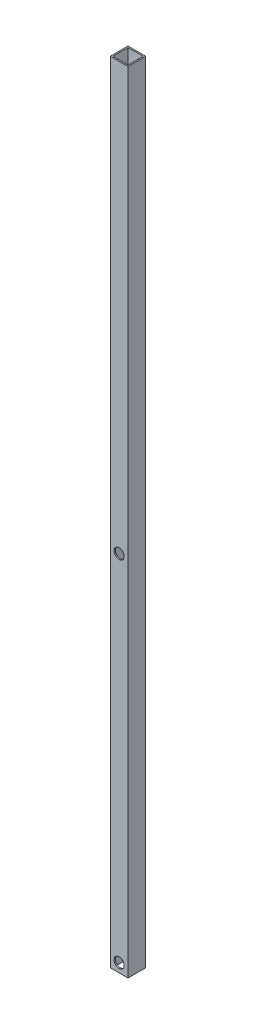
ISO-10303-21;
HEADER;
FILE_DESCRIPTION(('STEP AP214'),'2;1');
FILE_NAME('part.step','',(''),(''),'','','');
FILE_SCHEMA(('AUTOMOTIVE_DESIGN { 1 0 10303 214 1 1 1 1 }'));
ENDSEC;
DATA;
#1=APPLICATION_CONTEXT('core data for automotive mechanical design processes');
#2=APPLICATION_PROTOCOL_DEFINITION('international standard','automotive_design',2000,#1);
#3=PRODUCT_CONTEXT('',#1,'mechanical');
#4=PRODUCT('Part','Part','',(#3));
#5=PRODUCT_RELATED_PRODUCT_CATEGORY('part','',(#4));
#6=PRODUCT_DEFINITION_FORMATION('','',#4);
#7=PRODUCT_DEFINITION_CONTEXT('part definition',#1,'design');
#8=PRODUCT_DEFINITION('design','',#6,#7);
#9=PRODUCT_DEFINITION_SHAPE('','',#8);
#10=(LENGTH_UNIT() NAMED_UNIT(*) SI_UNIT(.MILLI.,.METRE.));
#11=(NAMED_UNIT(*) PLANE_ANGLE_UNIT() SI_UNIT($,.RADIAN.));
#12=(NAMED_UNIT(*) SI_UNIT($,.STERADIAN.) SOLID_ANGLE_UNIT());
#13=UNCERTAINTY_MEASURE_WITH_UNIT(LENGTH_MEASURE(1.E-05),#10,'distance_accuracy_value','');
#14=(GEOMETRIC_REPRESENTATION_CONTEXT(3) GLOBAL_UNCERTAINTY_ASSIGNED_CONTEXT((#13)) GLOBAL_UNIT_ASSIGNED_CONTEXT((#10,
#11,#12)) REPRESENTATION_CONTEXT('',''));
#15=CARTESIAN_POINT('',(0.,0.,0.));
#16=DIRECTION('',(0.,0.,1.));
#17=DIRECTION('',(1.,0.,0.));
#18=AXIS2_PLACEMENT_3D('',#15,#16,#17);
#19=CARTESIAN_POINT('',(0.,1981.2,0.));
#20=DIRECTION('',(0.,-1.,0.));
#21=DIRECTION('',(0.,0.,1.));
#22=AXIS2_PLACEMENT_3D('',#19,#20,#21);
#23=PLANE('',#22);
#24=DIRECTION('',(0.,0.,-1.));
#25=VECTOR('',#24,1.);
#26=CARTESIAN_POINT('',(0.,1981.2,0.));
#27=LINE('',#26,#25);
#28=CARTESIAN_POINT('',(0.,1981.2,44.45));
#29=VERTEX_POINT('',#28);
#30=CARTESIAN_POINT('',(0.,1981.2,0.));
#31=VERTEX_POINT('',#30);
#32=EDGE_CURVE('E162',#29,#31,#27,.T.);
#33=ORIENTED_EDGE('',*,*,#32,.F.);
#34=DIRECTION('',(-1.,0.,0.));
#35=VECTOR('',#34,1.);
#36=CARTESIAN_POINT('',(0.,1981.2,44.45));
#37=LINE('',#36,#35);
#38=CARTESIAN_POINT('',(44.45,1981.2,44.45));
#39=VERTEX_POINT('',#38);
#40=EDGE_CURVE('E175',#39,#29,#37,.T.);
#41=ORIENTED_EDGE('',*,*,#40,.F.);
#42=DIRECTION('',(0.,0.,1.));
#43=VECTOR('',#42,1.);
#44=CARTESIAN_POINT('',(44.45,1981.2,0.));
#45=LINE('',#44,#43);
#46=CARTESIAN_POINT('',(44.45,1981.2,0.));
#47=VERTEX_POINT('',#46);
#48=EDGE_CURVE('E171',#47,#39,#45,.T.);
#49=ORIENTED_EDGE('',*,*,#48,.F.);
#50=DIRECTION('',(1.,0.,0.));
#51=VECTOR('',#50,1.);
#52=CARTESIAN_POINT('',(0.,1981.2,0.));
#53=LINE('',#52,#51);
#54=EDGE_CURVE('E166',#31,#47,#53,.T.);
#55=ORIENTED_EDGE('',*,*,#54,.F.);
#56=EDGE_LOOP('',(#33,#41,#49,#55));
#57=FACE_BOUND('',#56,.T.);
#58=DIRECTION('',(1.,0.,0.));
#59=VECTOR('',#58,1.);
#60=CARTESIAN_POINT('',(3.175,1981.2,3.175));
#61=LINE('',#60,#59);
#62=CARTESIAN_POINT('',(3.175,1981.2,3.175));
#63=VERTEX_POINT('',#62);
#64=CARTESIAN_POINT('',(41.275,1981.2,3.175));
#65=VERTEX_POINT('',#64);
#66=EDGE_CURVE('E113',#63,#65,#61,.T.);
#67=ORIENTED_EDGE('',*,*,#66,.T.);
#68=DIRECTION('',(0.,0.,1.));
#69=VECTOR('',#68,1.);
#70=CARTESIAN_POINT('',(41.275,1981.2,3.175));
#71=LINE('',#70,#69);
#72=CARTESIAN_POINT('',(41.275,1981.2,41.275));
#73=VERTEX_POINT('',#72);
#74=EDGE_CURVE('E123',#65,#73,#71,.T.);
#75=ORIENTED_EDGE('',*,*,#74,.T.);
#76=DIRECTION('',(-1.,0.,0.));
#77=VECTOR('',#76,1.);
#78=CARTESIAN_POINT('',(3.175,1981.2,41.275));
#79=LINE('',#78,#77);
#80=CARTESIAN_POINT('',(3.175,1981.2,41.275));
#81=VERTEX_POINT('',#80);
#82=EDGE_CURVE('E128',#73,#81,#79,.T.);
#83=ORIENTED_EDGE('',*,*,#82,.T.);
#84=DIRECTION('',(0.,0.,-1.));
#85=VECTOR('',#84,1.);
#86=CARTESIAN_POINT('',(3.175,1981.2,3.175));
#87=LINE('',#86,#85);
#88=EDGE_CURVE('E131',#81,#63,#87,.T.);
#89=ORIENTED_EDGE('',*,*,#88,.T.);
#90=EDGE_LOOP('',(#67,#75,#83,#89));
#91=FACE_BOUND('',#90,.T.);
#92=ADVANCED_FACE('F45',(#57,#91),#23,.F.);
#93=CARTESIAN_POINT('',(0.,0.,0.));
#94=DIRECTION('',(0.,-1.,0.));
#95=DIRECTION('',(0.,0.,1.));
#96=AXIS2_PLACEMENT_3D('',#93,#94,#95);
#97=PLANE('',#96);
#98=DIRECTION('',(0.,0.,-1.));
#99=VECTOR('',#98,1.);
#100=CARTESIAN_POINT('',(0.,0.,0.));
#101=LINE('',#100,#99);
#102=CARTESIAN_POINT('',(0.,0.,44.45));
#103=VERTEX_POINT('',#102);
#104=CARTESIAN_POINT('',(0.,0.,0.));
#105=VERTEX_POINT('',#104);
#106=EDGE_CURVE('E119',#103,#105,#101,.T.);
#107=ORIENTED_EDGE('',*,*,#106,.T.);
#108=DIRECTION('',(1.,0.,0.));
#109=VECTOR('',#108,1.);
#110=CARTESIAN_POINT('',(0.,0.,0.));
#111=LINE('',#110,#109);
#112=CARTESIAN_POINT('',(44.45,0.,0.));
#113=VERTEX_POINT('',#112);
#114=EDGE_CURVE('E183',#105,#113,#111,.T.);
#115=ORIENTED_EDGE('',*,*,#114,.T.);
#116=DIRECTION('',(0.,0.,1.));
#117=VECTOR('',#116,1.);
#118=CARTESIAN_POINT('',(44.45,0.,0.));
#119=LINE('',#118,#117);
#120=CARTESIAN_POINT('',(44.45,0.,44.45));
#121=VERTEX_POINT('',#120);
#122=EDGE_CURVE('E187',#113,#121,#119,.T.);
#123=ORIENTED_EDGE('',*,*,#122,.T.);
#124=DIRECTION('',(-1.,0.,0.));
#125=VECTOR('',#124,1.);
#126=CARTESIAN_POINT('',(0.,0.,44.45));
#127=LINE('',#126,#125);
#128=EDGE_CURVE('E167',#121,#103,#127,.T.);
#129=ORIENTED_EDGE('',*,*,#128,.T.);
#130=EDGE_LOOP('',(#107,#115,#123,#129));
#131=FACE_BOUND('',#130,.T.);
#132=DIRECTION('',(0.,0.,-1.));
#133=VECTOR('',#132,1.);
#134=CARTESIAN_POINT('',(3.175,0.,3.175));
#135=LINE('',#134,#133);
#136=CARTESIAN_POINT('',(3.175,0.,41.275));
#137=VERTEX_POINT('',#136);
#138=CARTESIAN_POINT('',(3.175,0.,3.175));
#139=VERTEX_POINT('',#138);
#140=EDGE_CURVE('E133',#137,#139,#135,.T.);
#141=ORIENTED_EDGE('',*,*,#140,.F.);
#142=DIRECTION('',(-1.,0.,0.));
#143=VECTOR('',#142,1.);
#144=CARTESIAN_POINT('',(3.175,0.,41.275));
#145=LINE('',#144,#143);
#146=CARTESIAN_POINT('',(41.275,0.,41.275));
#147=VERTEX_POINT('',#146);
#148=EDGE_CURVE('E139',#147,#137,#145,.T.);
#149=ORIENTED_EDGE('',*,*,#148,.F.);
#150=DIRECTION('',(0.,0.,1.));
#151=VECTOR('',#150,1.);
#152=CARTESIAN_POINT('',(41.275,0.,3.175));
#153=LINE('',#152,#151);
#154=CARTESIAN_POINT('',(41.275,0.,3.175));
#155=VERTEX_POINT('',#154);
#156=EDGE_CURVE('E151',#155,#147,#153,.T.);
#157=ORIENTED_EDGE('',*,*,#156,.F.);
#158=DIRECTION('',(1.,0.,0.));
#159=VECTOR('',#158,1.);
#160=CARTESIAN_POINT('',(3.175,0.,3.175));
#161=LINE('',#160,#159);
#162=EDGE_CURVE('E114',#139,#155,#161,.T.);
#163=ORIENTED_EDGE('',*,*,#162,.F.);
#164=EDGE_LOOP('',(#141,#149,#157,#163));
#165=FACE_BOUND('',#164,.T.);
#166=ADVANCED_FACE('F208',(#131,#165),#97,.T.);
#167=CARTESIAN_POINT('',(0.,1981.2,0.));
#168=DIRECTION('',(1.,0.,0.));
#169=DIRECTION('',(0.,0.,1.));
#170=AXIS2_PLACEMENT_3D('',#167,#168,#169);
#171=PLANE('',#170);
#172=ORIENTED_EDGE('',*,*,#106,.F.);
#173=DIRECTION('',(0.,-1.,0.));
#174=VECTOR('',#173,1.);
#175=CARTESIAN_POINT('',(0.,1981.2,44.45));
#176=LINE('',#175,#174);
#177=EDGE_CURVE('E179',#29,#103,#176,.T.);
#178=ORIENTED_EDGE('',*,*,#177,.F.);
#179=ORIENTED_EDGE('',*,*,#32,.T.);
#180=DIRECTION('',(0.,-1.,0.));
#181=VECTOR('',#180,1.);
#182=CARTESIAN_POINT('',(0.,1981.2,0.));
#183=LINE('',#182,#181);
#184=EDGE_CURVE('E11',#31,#105,#183,.T.);
#185=ORIENTED_EDGE('',*,*,#184,.T.);
#186=EDGE_LOOP('',(#172,#178,#179,#185));
#187=FACE_BOUND('',#186,.T.);
#188=ADVANCED_FACE('F47',(#187),#171,.F.);
#189=CARTESIAN_POINT('',(0.,1981.2,0.));
#190=DIRECTION('',(0.,0.,1.));
#191=DIRECTION('',(-1.,0.,0.));
#192=AXIS2_PLACEMENT_3D('',#189,#190,#191);
#193=PLANE('',#192);
#194=CARTESIAN_POINT('',(22.225,22.225,0.));
#195=DIRECTION('',(0.,0.,1.));
#196=DIRECTION('',(1.,0.,0.));
#197=AXIS2_PLACEMENT_3D('',#194,#195,#196);
#198=CIRCLE('',#197,18.25625);
#199=CARTESIAN_POINT('',(40.48125,22.225,0.));
#200=VERTEX_POINT('',#199);
#201=EDGE_CURVE('E152',#200,#200,#198,.T.);
#202=ORIENTED_EDGE('',*,*,#201,.T.);
#203=EDGE_LOOP('',(#202));
#204=FACE_BOUND('',#203,.T.);
#205=CARTESIAN_POINT('',(22.225,911.225,0.));
#206=DIRECTION('',(0.,0.,1.));
#207=DIRECTION('',(1.,0.,0.));
#208=AXIS2_PLACEMENT_3D('',#205,#206,#207);
#209=CIRCLE('',#208,18.25625);
#210=CARTESIAN_POINT('',(40.48125,911.225,0.));
#211=VERTEX_POINT('',#210);
#212=EDGE_CURVE('E142',#211,#211,#209,.T.);
#213=ORIENTED_EDGE('',*,*,#212,.T.);
#214=EDGE_LOOP('',(#213));
#215=FACE_BOUND('',#214,.T.);
#216=ORIENTED_EDGE('',*,*,#114,.F.);
#217=ORIENTED_EDGE('',*,*,#184,.F.);
#218=ORIENTED_EDGE('',*,*,#54,.T.);
#219=DIRECTION('',(0.,-1.,0.));
#220=VECTOR('',#219,1.);
#221=CARTESIAN_POINT('',(44.45,1981.2,0.));
#222=LINE('',#221,#220);
#223=EDGE_CURVE('E54',#47,#113,#222,.T.);
#224=ORIENTED_EDGE('',*,*,#223,.T.);
#225=EDGE_LOOP('',(#216,#217,#218,#224));
#226=FACE_BOUND('',#225,.T.);
#227=ADVANCED_FACE('F201',(#204,#215,#226),#193,.F.);
#228=CARTESIAN_POINT('',(44.45,1981.2,0.));
#229=DIRECTION('',(-1.,0.,0.));
#230=DIRECTION('',(0.,0.,-1.));
#231=AXIS2_PLACEMENT_3D('',#228,#229,#230);
#232=PLANE('',#231);
#233=ORIENTED_EDGE('',*,*,#122,.F.);
#234=ORIENTED_EDGE('',*,*,#223,.F.);
#235=ORIENTED_EDGE('',*,*,#48,.T.);
#236=DIRECTION('',(0.,-1.,0.));
#237=VECTOR('',#236,1.);
#238=CARTESIAN_POINT('',(44.45,1981.2,44.45));
#239=LINE('',#238,#237);
#240=EDGE_CURVE('E196',#39,#121,#239,.T.);
#241=ORIENTED_EDGE('',*,*,#240,.T.);
#242=EDGE_LOOP('',(#233,#234,#235,#241));
#243=FACE_BOUND('',#242,.T.);
#244=ADVANCED_FACE('F205',(#243),#232,.F.);
#245=CARTESIAN_POINT('',(0.,1981.2,44.45));
#246=DIRECTION('',(0.,0.,-1.));
#247=DIRECTION('',(1.,0.,0.));
#248=AXIS2_PLACEMENT_3D('',#245,#246,#247);
#249=PLANE('',#248);
#250=CARTESIAN_POINT('',(22.225,911.225,44.45));
#251=DIRECTION('',(0.,0.,-1.));
#252=DIRECTION('',(-1.,0.,0.));
#253=AXIS2_PLACEMENT_3D('',#250,#251,#252);
#254=CIRCLE('',#253,12.7);
#255=CARTESIAN_POINT('',(9.525,911.225,44.45));
#256=VERTEX_POINT('',#255);
#257=EDGE_CURVE('E265',#256,#256,#254,.T.);
#258=ORIENTED_EDGE('',*,*,#257,.T.);
#259=EDGE_LOOP('',(#258));
#260=FACE_BOUND('',#259,.T.);
#261=CARTESIAN_POINT('',(22.225,22.225,44.45));
#262=DIRECTION('',(0.,0.,-1.));
#263=DIRECTION('',(-1.,0.,0.));
#264=AXIS2_PLACEMENT_3D('',#261,#262,#263);
#265=CIRCLE('',#264,12.7);
#266=CARTESIAN_POINT('',(9.525,22.225,44.45));
#267=VERTEX_POINT('',#266);
#268=EDGE_CURVE('E272',#267,#267,#265,.T.);
#269=ORIENTED_EDGE('',*,*,#268,.T.);
#270=EDGE_LOOP('',(#269));
#271=FACE_BOUND('',#270,.T.);
#272=ORIENTED_EDGE('',*,*,#128,.F.);
#273=ORIENTED_EDGE('',*,*,#240,.F.);
#274=ORIENTED_EDGE('',*,*,#40,.T.);
#275=ORIENTED_EDGE('',*,*,#177,.T.);
#276=EDGE_LOOP('',(#272,#273,#274,#275));
#277=FACE_BOUND('',#276,.T.);
#278=ADVANCED_FACE('F216',(#260,#271,#277),#249,.F.);
#279=CARTESIAN_POINT('',(3.175,1981.2,3.175));
#280=DIRECTION('',(0.,0.,1.));
#281=DIRECTION('',(-1.,0.,0.));
#282=AXIS2_PLACEMENT_3D('',#279,#280,#281);
#283=PLANE('',#282);
#284=CARTESIAN_POINT('',(22.225,22.225,3.175));
#285=DIRECTION('',(0.,0.,-1.));
#286=DIRECTION('',(-1.,0.,0.));
#287=AXIS2_PLACEMENT_3D('',#284,#285,#286);
#288=CIRCLE('',#287,18.25625);
#289=CARTESIAN_POINT('',(3.96875,22.225,3.175));
#290=VERTEX_POINT('',#289);
#291=EDGE_CURVE('E282',#290,#290,#288,.F.);
#292=ORIENTED_EDGE('',*,*,#291,.F.);
#293=EDGE_LOOP('',(#292));
#294=FACE_BOUND('',#293,.T.);
#295=CARTESIAN_POINT('',(22.225,911.225,3.175));
#296=DIRECTION('',(0.,0.,-1.));
#297=DIRECTION('',(-1.,0.,0.));
#298=AXIS2_PLACEMENT_3D('',#295,#296,#297);
#299=CIRCLE('',#298,18.25625);
#300=CARTESIAN_POINT('',(3.96875,911.225,3.175));
#301=VERTEX_POINT('',#300);
#302=EDGE_CURVE('E267',#301,#301,#299,.F.);
#303=ORIENTED_EDGE('',*,*,#302,.F.);
#304=EDGE_LOOP('',(#303));
#305=FACE_BOUND('',#304,.T.);
#306=ORIENTED_EDGE('',*,*,#162,.T.);
#307=DIRECTION('',(0.,-1.,0.));
#308=VECTOR('',#307,1.);
#309=CARTESIAN_POINT('',(41.275,1981.2,3.175));
#310=LINE('',#309,#308);
#311=EDGE_CURVE('E109',#65,#155,#310,.T.);
#312=ORIENTED_EDGE('',*,*,#311,.F.);
#313=ORIENTED_EDGE('',*,*,#66,.F.);
#314=DIRECTION('',(0.,-1.,0.));
#315=VECTOR('',#314,1.);
#316=CARTESIAN_POINT('',(3.175,1981.2,3.175));
#317=LINE('',#316,#315);
#318=EDGE_CURVE('E69',#63,#139,#317,.T.);
#319=ORIENTED_EDGE('',*,*,#318,.T.);
#320=EDGE_LOOP('',(#306,#312,#313,#319));
#321=FACE_BOUND('',#320,.T.);
#322=ADVANCED_FACE('F111',(#294,#305,#321),#283,.T.);
#323=CARTESIAN_POINT('',(41.275,1981.2,3.175));
#324=DIRECTION('',(-1.,0.,0.));
#325=DIRECTION('',(0.,0.,-1.));
#326=AXIS2_PLACEMENT_3D('',#323,#324,#325);
#327=PLANE('',#326);
#328=ORIENTED_EDGE('',*,*,#156,.T.);
#329=DIRECTION('',(0.,-1.,0.));
#330=VECTOR('',#329,1.);
#331=CARTESIAN_POINT('',(41.275,1981.2,41.275));
#332=LINE('',#331,#330);
#333=EDGE_CURVE('E120',#73,#147,#332,.T.);
#334=ORIENTED_EDGE('',*,*,#333,.F.);
#335=ORIENTED_EDGE('',*,*,#74,.F.);
#336=ORIENTED_EDGE('',*,*,#311,.T.);
#337=EDGE_LOOP('',(#328,#334,#335,#336));
#338=FACE_BOUND('',#337,.T.);
#339=ADVANCED_FACE('F124',(#338),#327,.T.);
#340=CARTESIAN_POINT('',(3.175,1981.2,41.275));
#341=DIRECTION('',(0.,0.,-1.));
#342=DIRECTION('',(1.,0.,0.));
#343=AXIS2_PLACEMENT_3D('',#340,#341,#342);
#344=PLANE('',#343);
#345=CARTESIAN_POINT('',(22.225,911.225,41.275));
#346=DIRECTION('',(0.,0.,1.));
#347=DIRECTION('',(1.,0.,0.));
#348=AXIS2_PLACEMENT_3D('',#345,#346,#347);
#349=CIRCLE('',#348,12.7);
#350=CARTESIAN_POINT('',(34.925,911.225,41.275));
#351=VERTEX_POINT('',#350);
#352=EDGE_CURVE('E263',#351,#351,#349,.F.);
#353=ORIENTED_EDGE('',*,*,#352,.F.);
#354=EDGE_LOOP('',(#353));
#355=FACE_BOUND('',#354,.T.);
#356=CARTESIAN_POINT('',(22.225,22.225,41.275));
#357=DIRECTION('',(0.,0.,1.));
#358=DIRECTION('',(1.,0.,0.));
#359=AXIS2_PLACEMENT_3D('',#356,#357,#358);
#360=CIRCLE('',#359,12.7);
#361=CARTESIAN_POINT('',(34.925,22.225,41.275));
#362=VERTEX_POINT('',#361);
#363=EDGE_CURVE('E278',#362,#362,#360,.F.);
#364=ORIENTED_EDGE('',*,*,#363,.F.);
#365=EDGE_LOOP('',(#364));
#366=FACE_BOUND('',#365,.T.);
#367=ORIENTED_EDGE('',*,*,#148,.T.);
#368=DIRECTION('',(0.,-1.,0.));
#369=VECTOR('',#368,1.);
#370=CARTESIAN_POINT('',(3.175,1981.2,41.275));
#371=LINE('',#370,#369);
#372=EDGE_CURVE('E61',#81,#137,#371,.T.);
#373=ORIENTED_EDGE('',*,*,#372,.F.);
#374=ORIENTED_EDGE('',*,*,#82,.F.);
#375=ORIENTED_EDGE('',*,*,#333,.T.);
#376=EDGE_LOOP('',(#367,#373,#374,#375));
#377=FACE_BOUND('',#376,.T.);
#378=ADVANCED_FACE('F236',(#355,#366,#377),#344,.T.);
#379=CARTESIAN_POINT('',(3.175,1981.2,3.175));
#380=DIRECTION('',(1.,0.,0.));
#381=DIRECTION('',(0.,0.,1.));
#382=AXIS2_PLACEMENT_3D('',#379,#380,#381);
#383=PLANE('',#382);
#384=ORIENTED_EDGE('',*,*,#140,.T.);
#385=ORIENTED_EDGE('',*,*,#318,.F.);
#386=ORIENTED_EDGE('',*,*,#88,.F.);
#387=ORIENTED_EDGE('',*,*,#372,.T.);
#388=EDGE_LOOP('',(#384,#385,#386,#387));
#389=FACE_BOUND('',#388,.T.);
#390=ADVANCED_FACE('F239',(#389),#383,.T.);
#391=CARTESIAN_POINT('',(22.225,911.225,44.451));
#392=DIRECTION('',(0.,0.,-1.));
#393=DIRECTION('',(1.,0.,0.));
#394=AXIS2_PLACEMENT_3D('',#391,#392,#393);
#395=CYLINDRICAL_SURFACE('',#394,18.25625);
#396=ORIENTED_EDGE('',*,*,#302,.T.);
#397=EDGE_LOOP('',(#396));
#398=FACE_BOUND('',#397,.T.);
#399=ORIENTED_EDGE('',*,*,#212,.F.);
#400=EDGE_LOOP('',(#399));
#401=FACE_BOUND('',#400,.T.);
#402=ADVANCED_FACE('F243',(#398,#401),#395,.F.);
#403=CARTESIAN_POINT('',(22.225,22.225,44.451));
#404=DIRECTION('',(0.,0.,-1.));
#405=DIRECTION('',(1.,0.,0.));
#406=AXIS2_PLACEMENT_3D('',#403,#404,#405);
#407=CYLINDRICAL_SURFACE('',#406,18.25625);
#408=ORIENTED_EDGE('',*,*,#291,.T.);
#409=EDGE_LOOP('',(#408));
#410=FACE_BOUND('',#409,.T.);
#411=ORIENTED_EDGE('',*,*,#201,.F.);
#412=EDGE_LOOP('',(#411));
#413=FACE_BOUND('',#412,.T.);
#414=ADVANCED_FACE('F247',(#410,#413),#407,.F.);
#415=CARTESIAN_POINT('',(22.225,22.225,-0.001000000000001));
#416=DIRECTION('',(0.,0.,1.));
#417=DIRECTION('',(-1.,0.,0.));
#418=AXIS2_PLACEMENT_3D('',#415,#416,#417);
#419=CYLINDRICAL_SURFACE('',#418,12.7);
#420=ORIENTED_EDGE('',*,*,#363,.T.);
#421=EDGE_LOOP('',(#420));
#422=FACE_BOUND('',#421,.T.);
#423=ORIENTED_EDGE('',*,*,#268,.F.);
#424=EDGE_LOOP('',(#423));
#425=FACE_BOUND('',#424,.T.);
#426=ADVANCED_FACE('F251',(#422,#425),#419,.F.);
#427=CARTESIAN_POINT('',(22.225,911.225,-0.001000000000001));
#428=DIRECTION('',(0.,0.,1.));
#429=DIRECTION('',(-1.,0.,0.));
#430=AXIS2_PLACEMENT_3D('',#427,#428,#429);
#431=CYLINDRICAL_SURFACE('',#430,12.7);
#432=ORIENTED_EDGE('',*,*,#352,.T.);
#433=EDGE_LOOP('',(#432));
#434=FACE_BOUND('',#433,.T.);
#435=ORIENTED_EDGE('',*,*,#257,.F.);
#436=EDGE_LOOP('',(#435));
#437=FACE_BOUND('',#436,.T.);
#438=ADVANCED_FACE('F255',(#434,#437),#431,.F.);
#439=CLOSED_SHELL('',(#92,#166,#188,#227,#244,#278,#322,#339,#378,#390,#402,#414,#426,#438));
#440=MANIFOLD_SOLID_BREP('B2',#439);
#441=ADVANCED_BREP_SHAPE_REPRESENTATION('',(#18,#440),#14);
#442=SHAPE_DEFINITION_REPRESENTATION(#9,#441);
ENDSEC;
END-ISO-10303-21;
